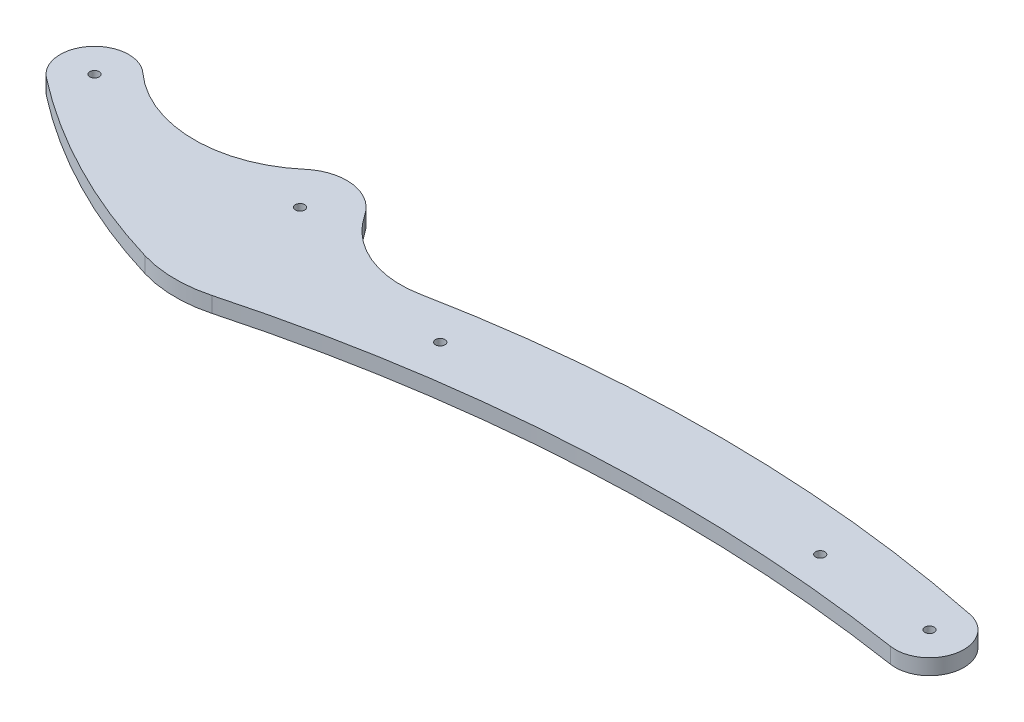
ISO-10303-21;
HEADER;
FILE_DESCRIPTION(('STEP AP214'),'2;1');
FILE_NAME('part.step','',(''),(''),'','','');
FILE_SCHEMA(('AUTOMOTIVE_DESIGN { 1 0 10303 214 1 1 1 1 }'));
ENDSEC;
DATA;
#1=APPLICATION_CONTEXT('core data for automotive mechanical design processes');
#2=APPLICATION_PROTOCOL_DEFINITION('international standard','automotive_design',2000,#1);
#3=PRODUCT_CONTEXT('',#1,'mechanical');
#4=PRODUCT('Part','Part','',(#3));
#5=PRODUCT_RELATED_PRODUCT_CATEGORY('part','',(#4));
#6=PRODUCT_DEFINITION_FORMATION('','',#4);
#7=PRODUCT_DEFINITION_CONTEXT('part definition',#1,'design');
#8=PRODUCT_DEFINITION('design','',#6,#7);
#9=PRODUCT_DEFINITION_SHAPE('','',#8);
#10=(LENGTH_UNIT() NAMED_UNIT(*) SI_UNIT(.MILLI.,.METRE.));
#11=(NAMED_UNIT(*) PLANE_ANGLE_UNIT() SI_UNIT($,.RADIAN.));
#12=(NAMED_UNIT(*) SI_UNIT($,.STERADIAN.) SOLID_ANGLE_UNIT());
#13=UNCERTAINTY_MEASURE_WITH_UNIT(LENGTH_MEASURE(1.E-05),#10,'distance_accuracy_value','');
#14=(GEOMETRIC_REPRESENTATION_CONTEXT(3) GLOBAL_UNCERTAINTY_ASSIGNED_CONTEXT((#13)) GLOBAL_UNIT_ASSIGNED_CONTEXT((#10,
#11,#12)) REPRESENTATION_CONTEXT('',''));
#15=CARTESIAN_POINT('',(0.,0.,0.));
#16=DIRECTION('',(0.,0.,1.));
#17=DIRECTION('',(1.,0.,0.));
#18=AXIS2_PLACEMENT_3D('',#15,#16,#17);
#19=CARTESIAN_POINT('',(288.5,5.,20.4));
#20=DIRECTION('',(0.,-1.,0.));
#21=DIRECTION('',(0.,0.,-1.));
#22=AXIS2_PLACEMENT_3D('',#19,#20,#21);
#23=CYLINDRICAL_SURFACE('',#22,11.);
#24=CARTESIAN_POINT('',(288.5,0.,20.4));
#25=DIRECTION('',(0.,1.,0.));
#26=DIRECTION('',(0.,0.,1.));
#27=AXIS2_PLACEMENT_3D('',#24,#25,#26);
#28=CIRCLE('',#27,11.);
#29=CARTESIAN_POINT('',(286.820423182921,0.,31.2710175105889));
#30=VERTEX_POINT('',#29);
#31=CARTESIAN_POINT('',(290.713941840011,0.,9.62510039355124));
#32=VERTEX_POINT('',#31);
#33=EDGE_CURVE('E175',#30,#32,#28,.T.);
#34=ORIENTED_EDGE('',*,*,#33,.T.);
#35=DIRECTION('',(0.,-1.,0.));
#36=VECTOR('',#35,1.);
#37=CARTESIAN_POINT('',(290.713941840011,5.,9.62510039355124));
#38=LINE('',#37,#36);
#39=CARTESIAN_POINT('',(290.713941840011,5.,9.62510039355124));
#40=VERTEX_POINT('',#39);
#41=EDGE_CURVE('E11',#40,#32,#38,.T.);
#42=ORIENTED_EDGE('',*,*,#41,.F.);
#43=CARTESIAN_POINT('',(288.5,5.,20.4));
#44=DIRECTION('',(0.,1.,0.));
#45=DIRECTION('',(0.,0.,1.));
#46=AXIS2_PLACEMENT_3D('',#43,#44,#45);
#47=CIRCLE('',#46,11.);
#48=CARTESIAN_POINT('',(286.820423182921,5.,31.2710175105889));
#49=VERTEX_POINT('',#48);
#50=EDGE_CURVE('E247',#49,#40,#47,.T.);
#51=ORIENTED_EDGE('',*,*,#50,.F.);
#52=DIRECTION('',(0.,-1.,0.));
#53=VECTOR('',#52,1.);
#54=CARTESIAN_POINT('',(286.820423182921,5.,31.2710175105889));
#55=LINE('',#54,#53);
#56=EDGE_CURVE('E63',#49,#30,#55,.T.);
#57=ORIENTED_EDGE('',*,*,#56,.T.);
#58=EDGE_LOOP('',(#34,#42,#51,#57));
#59=FACE_BOUND('',#58,.T.);
#60=ADVANCED_FACE('F45',(#59),#23,.T.);
#61=CARTESIAN_POINT('',(200.143593839572,5.,450.416447930092));
#62=DIRECTION('',(0.,-1.,0.));
#63=DIRECTION('',(0.,0.,-1.));
#64=AXIS2_PLACEMENT_3D('',#61,#62,#63);
#65=CYLINDRICAL_SURFACE('',#64,450.);
#66=CARTESIAN_POINT('',(200.143593839572,0.,450.416447930092));
#67=DIRECTION('',(0.,1.,0.));
#68=DIRECTION('',(0.,0.,1.));
#69=AXIS2_PLACEMENT_3D('',#66,#67,#68);
#70=CIRCLE('',#69,450.);
#71=CARTESIAN_POINT('',(113.463070734292,0.,8.84370543550006));
#72=VERTEX_POINT('',#71);
#73=EDGE_CURVE('E178',#32,#72,#70,.T.);
#74=ORIENTED_EDGE('',*,*,#73,.T.);
#75=DIRECTION('',(0.,-1.,0.));
#76=VECTOR('',#75,1.);
#77=CARTESIAN_POINT('',(113.463070734292,5.,8.84370543550006));
#78=LINE('',#77,#76);
#79=CARTESIAN_POINT('',(113.463070734292,5.,8.84370543550006));
#80=VERTEX_POINT('',#79);
#81=EDGE_CURVE('E55',#80,#72,#78,.T.);
#82=ORIENTED_EDGE('',*,*,#81,.F.);
#83=CARTESIAN_POINT('',(200.143593839572,5.,450.416447930092));
#84=DIRECTION('',(0.,1.,0.));
#85=DIRECTION('',(0.,0.,1.));
#86=AXIS2_PLACEMENT_3D('',#83,#84,#85);
#87=CIRCLE('',#86,450.);
#88=EDGE_CURVE('E105',#40,#80,#87,.T.);
#89=ORIENTED_EDGE('',*,*,#88,.F.);
#90=ORIENTED_EDGE('',*,*,#41,.T.);
#91=EDGE_LOOP('',(#74,#82,#89,#90));
#92=FACE_BOUND('',#91,.T.);
#93=ADVANCED_FACE('F228',(#92),#65,.T.);
#94=CARTESIAN_POINT('',(107.68436919394,5.,-20.5944773974727));
#95=DIRECTION('',(0.,-1.,0.));
#96=DIRECTION('',(0.,0.,-1.));
#97=AXIS2_PLACEMENT_3D('',#94,#95,#96);
#98=CYLINDRICAL_SURFACE('',#97,30.);
#99=CARTESIAN_POINT('',(107.68436919394,0.,-20.5944773974727));
#100=DIRECTION('',(0.,1.,0.));
#101=DIRECTION('',(0.,0.,1.));
#102=AXIS2_PLACEMENT_3D('',#99,#100,#101);
#103=CIRCLE('',#102,30.);
#104=CARTESIAN_POINT('',(82.5614563979801,0.,-4.19815913249092));
#105=VERTEX_POINT('',#104);
#106=EDGE_CURVE('E182',#105,#72,#103,.T.);
#107=ORIENTED_EDGE('',*,*,#106,.F.);
#108=DIRECTION('',(0.,-1.,0.));
#109=VECTOR('',#108,1.);
#110=CARTESIAN_POINT('',(82.5614563979801,5.,-4.19815913249092));
#111=LINE('',#110,#109);
#112=CARTESIAN_POINT('',(82.5614563979801,5.,-4.19815913249092));
#113=VERTEX_POINT('',#112);
#114=EDGE_CURVE('E219',#113,#105,#111,.T.);
#115=ORIENTED_EDGE('',*,*,#114,.F.);
#116=CARTESIAN_POINT('',(107.68436919394,5.,-20.5944773974727));
#117=DIRECTION('',(0.,1.,0.));
#118=DIRECTION('',(0.,0.,1.));
#119=AXIS2_PLACEMENT_3D('',#116,#117,#118);
#120=CIRCLE('',#119,30.);
#121=EDGE_CURVE('E227',#113,#80,#120,.T.);
#122=ORIENTED_EDGE('',*,*,#121,.T.);
#123=ORIENTED_EDGE('',*,*,#81,.T.);
#124=EDGE_LOOP('',(#107,#115,#122,#123));
#125=FACE_BOUND('',#124,.T.);
#126=ADVANCED_FACE('F225',(#125),#98,.F.);
#127=CARTESIAN_POINT('',(70.,5.,4.));
#128=DIRECTION('',(0.,-1.,0.));
#129=DIRECTION('',(0.,0.,-1.));
#130=AXIS2_PLACEMENT_3D('',#127,#128,#129);
#131=CYLINDRICAL_SURFACE('',#130,15.);
#132=CARTESIAN_POINT('',(70.,0.,4.));
#133=DIRECTION('',(0.,1.,0.));
#134=DIRECTION('',(0.,0.,1.));
#135=AXIS2_PLACEMENT_3D('',#132,#133,#134);
#136=CIRCLE('',#135,15.);
#137=CARTESIAN_POINT('',(60.2487118059048,0.,-7.39791114878956));
#138=VERTEX_POINT('',#137);
#139=EDGE_CURVE('E186',#105,#138,#136,.T.);
#140=ORIENTED_EDGE('',*,*,#139,.T.);
#141=DIRECTION('',(0.,-1.,0.));
#142=VECTOR('',#141,1.);
#143=CARTESIAN_POINT('',(60.2487118059048,5.,-7.39791114878956));
#144=LINE('',#143,#142);
#145=CARTESIAN_POINT('',(60.2487118059048,5.,-7.39791114878956));
#146=VERTEX_POINT('',#145);
#147=EDGE_CURVE('E216',#146,#138,#144,.T.);
#148=ORIENTED_EDGE('',*,*,#147,.F.);
#149=CARTESIAN_POINT('',(70.,5.,4.));
#150=DIRECTION('',(0.,1.,0.));
#151=DIRECTION('',(0.,0.,1.));
#152=AXIS2_PLACEMENT_3D('',#149,#150,#151);
#153=CIRCLE('',#152,15.);
#154=EDGE_CURVE('E240',#113,#146,#153,.T.);
#155=ORIENTED_EDGE('',*,*,#154,.F.);
#156=ORIENTED_EDGE('',*,*,#114,.T.);
#157=EDGE_LOOP('',(#140,#148,#155,#156));
#158=FACE_BOUND('',#157,.T.);
#159=ADVANCED_FACE('F237',(#158),#131,.T.);
#160=CARTESIAN_POINT('',(34.2452766216511,5.,-37.792340878895));
#161=DIRECTION('',(0.,-1.,0.));
#162=DIRECTION('',(0.,0.,-1.));
#163=AXIS2_PLACEMENT_3D('',#160,#161,#162);
#164=CYLINDRICAL_SURFACE('',#163,40.);
#165=CARTESIAN_POINT('',(34.2452766216511,0.,-37.792340878895));
#166=DIRECTION('',(0.,1.,0.));
#167=DIRECTION('',(0.,0.,1.));
#168=AXIS2_PLACEMENT_3D('',#165,#166,#167);
#169=CIRCLE('',#168,40.);
#170=CARTESIAN_POINT('',(7.38623613408162,0.,-8.15128920917342));
#171=VERTEX_POINT('',#170);
#172=EDGE_CURVE('E190',#171,#138,#169,.T.);
#173=ORIENTED_EDGE('',*,*,#172,.F.);
#174=DIRECTION('',(0.,-1.,0.));
#175=VECTOR('',#174,1.);
#176=CARTESIAN_POINT('',(7.38623613408162,5.,-8.15128920917342));
#177=LINE('',#176,#175);
#178=CARTESIAN_POINT('',(7.38623613408162,5.,-8.15128920917342));
#179=VERTEX_POINT('',#178);
#180=EDGE_CURVE('E213',#179,#171,#177,.T.);
#181=ORIENTED_EDGE('',*,*,#180,.F.);
#182=CARTESIAN_POINT('',(34.2452766216511,5.,-37.792340878895));
#183=DIRECTION('',(0.,1.,0.));
#184=DIRECTION('',(0.,0.,1.));
#185=AXIS2_PLACEMENT_3D('',#182,#183,#184);
#186=CIRCLE('',#185,40.);
#187=EDGE_CURVE('E242',#179,#146,#186,.T.);
#188=ORIENTED_EDGE('',*,*,#187,.T.);
#189=ORIENTED_EDGE('',*,*,#147,.T.);
#190=EDGE_LOOP('',(#173,#181,#188,#189));
#191=FACE_BOUND('',#190,.T.);
#192=ADVANCED_FACE('F254',(#191),#164,.F.);
#193=CARTESIAN_POINT('',(0.,5.,0.));
#194=DIRECTION('',(0.,-1.,0.));
#195=DIRECTION('',(0.,0.,-1.));
#196=AXIS2_PLACEMENT_3D('',#193,#194,#195);
#197=CYLINDRICAL_SURFACE('',#196,11.);
#198=CARTESIAN_POINT('',(0.,0.,0.));
#199=DIRECTION('',(0.,1.,0.));
#200=DIRECTION('',(0.,0.,1.));
#201=AXIS2_PLACEMENT_3D('',#198,#199,#200);
#202=CIRCLE('',#201,11.);
#203=CARTESIAN_POINT('',(-6.74762763379508,0.,8.6873195702498));
#204=VERTEX_POINT('',#203);
#205=EDGE_CURVE('E194',#171,#204,#202,.T.);
#206=ORIENTED_EDGE('',*,*,#205,.T.);
#207=DIRECTION('',(0.,-1.,0.));
#208=VECTOR('',#207,1.);
#209=CARTESIAN_POINT('',(-6.74762763379508,5.,8.6873195702498));
#210=LINE('',#209,#208);
#211=CARTESIAN_POINT('',(-6.74762763379508,5.,8.6873195702498));
#212=VERTEX_POINT('',#211);
#213=EDGE_CURVE('E145',#212,#204,#210,.T.);
#214=ORIENTED_EDGE('',*,*,#213,.F.);
#215=CARTESIAN_POINT('',(0.,5.,0.));
#216=DIRECTION('',(0.,1.,0.));
#217=DIRECTION('',(0.,0.,1.));
#218=AXIS2_PLACEMENT_3D('',#215,#216,#217);
#219=CIRCLE('',#218,11.);
#220=EDGE_CURVE('E131',#179,#212,#219,.T.);
#221=ORIENTED_EDGE('',*,*,#220,.F.);
#222=ORIENTED_EDGE('',*,*,#180,.T.);
#223=EDGE_LOOP('',(#206,#214,#221,#222));
#224=FACE_BOUND('',#223,.T.);
#225=ADVANCED_FACE('F256',(#224),#197,.T.);
#226=CARTESIAN_POINT('',(115.936511162479,5.,-149.263945343383));
#227=DIRECTION('',(0.,-1.,0.));
#228=DIRECTION('',(0.,0.,-1.));
#229=AXIS2_PLACEMENT_3D('',#226,#227,#228);
#230=CYLINDRICAL_SURFACE('',#229,200.);
#231=CARTESIAN_POINT('',(115.936511162479,0.,-149.263945343383));
#232=DIRECTION('',(0.,1.,0.));
#233=DIRECTION('',(0.,0.,1.));
#234=AXIS2_PLACEMENT_3D('',#231,#232,#233);
#235=CIRCLE('',#234,200.);
#236=CARTESIAN_POINT('',(58.5158722093802,0.,42.3159863358457));
#237=VERTEX_POINT('',#236);
#238=EDGE_CURVE('E141',#204,#237,#235,.T.);
#239=ORIENTED_EDGE('',*,*,#238,.T.);
#240=DIRECTION('',(0.,-1.,0.));
#241=VECTOR('',#240,1.);
#242=CARTESIAN_POINT('',(58.5158722093802,5.,42.3159863358457));
#243=LINE('',#242,#241);
#244=CARTESIAN_POINT('',(58.5158722093802,5.,42.3159863358457));
#245=VERTEX_POINT('',#244);
#246=EDGE_CURVE('E138',#245,#237,#243,.T.);
#247=ORIENTED_EDGE('',*,*,#246,.F.);
#248=CARTESIAN_POINT('',(115.936511162479,5.,-149.263945343383));
#249=DIRECTION('',(0.,1.,0.));
#250=DIRECTION('',(0.,0.,1.));
#251=AXIS2_PLACEMENT_3D('',#248,#249,#250);
#252=CIRCLE('',#251,200.);
#253=EDGE_CURVE('E123',#212,#245,#252,.T.);
#254=ORIENTED_EDGE('',*,*,#253,.F.);
#255=ORIENTED_EDGE('',*,*,#213,.T.);
#256=EDGE_LOOP('',(#239,#247,#254,#255));
#257=FACE_BOUND('',#256,.T.);
#258=ADVANCED_FACE('F139',(#257),#230,.T.);
#259=CARTESIAN_POINT('',(70.,5.,4.));
#260=DIRECTION('',(0.,-1.,0.));
#261=DIRECTION('',(0.,0.,-1.));
#262=AXIS2_PLACEMENT_3D('',#259,#260,#261);
#263=CYLINDRICAL_SURFACE('',#262,40.);
#264=CARTESIAN_POINT('',(70.,0.,4.));
#265=DIRECTION('',(0.,1.,0.));
#266=DIRECTION('',(0.,0.,1.));
#267=AXIS2_PLACEMENT_3D('',#264,#265,#266);
#268=CIRCLE('',#267,40.);
#269=CARTESIAN_POINT('',(80.4056312893777,0.,42.6228279320601));
#270=VERTEX_POINT('',#269);
#271=EDGE_CURVE('E199',#237,#270,#268,.T.);
#272=ORIENTED_EDGE('',*,*,#271,.T.);
#273=DIRECTION('',(0.,-1.,0.));
#274=VECTOR('',#273,1.);
#275=CARTESIAN_POINT('',(80.4056312893777,5.,42.6228279320601));
#276=LINE('',#275,#274);
#277=CARTESIAN_POINT('',(80.4056312893777,5.,42.6228279320601));
#278=VERTEX_POINT('',#277);
#279=EDGE_CURVE('E93',#278,#270,#276,.T.);
#280=ORIENTED_EDGE('',*,*,#279,.F.);
#281=CARTESIAN_POINT('',(70.,5.,4.));
#282=DIRECTION('',(0.,1.,0.));
#283=DIRECTION('',(0.,0.,1.));
#284=AXIS2_PLACEMENT_3D('',#281,#282,#283);
#285=CIRCLE('',#284,40.);
#286=EDGE_CURVE('E128',#245,#278,#285,.T.);
#287=ORIENTED_EDGE('',*,*,#286,.F.);
#288=ORIENTED_EDGE('',*,*,#246,.T.);
#289=EDGE_LOOP('',(#272,#280,#287,#288));
#290=FACE_BOUND('',#289,.T.);
#291=ADVANCED_FACE('F147',(#290),#263,.T.);
#292=CARTESIAN_POINT('',(288.5,5.,20.4));
#293=DIRECTION('',(0.,-1.,0.));
#294=DIRECTION('',(0.,0.,-1.));
#295=AXIS2_PLACEMENT_3D('',#292,#293,#294);
#296=CYLINDRICAL_SURFACE('',#295,1.49999999999997);
#297=CARTESIAN_POINT('',(288.5,5.,20.4));
#298=DIRECTION('',(0.,1.,0.));
#299=DIRECTION('',(0.,0.,1.));
#300=AXIS2_PLACEMENT_3D('',#297,#298,#299);
#301=CIRCLE('',#300,1.49999999999997);
#302=CARTESIAN_POINT('',(288.5,5.,21.9));
#303=VERTEX_POINT('',#302);
#304=EDGE_CURVE('E459',#303,#303,#301,.T.);
#305=ORIENTED_EDGE('',*,*,#304,.T.);
#306=EDGE_LOOP('',(#305));
#307=FACE_BOUND('',#306,.T.);
#308=CARTESIAN_POINT('',(288.5,0.,20.4));
#309=DIRECTION('',(0.,1.,0.));
#310=DIRECTION('',(0.,0.,1.));
#311=AXIS2_PLACEMENT_3D('',#308,#309,#310);
#312=CIRCLE('',#311,1.49999999999997);
#313=CARTESIAN_POINT('',(288.5,0.,21.9));
#314=VERTEX_POINT('',#313);
#315=EDGE_CURVE('E171',#314,#314,#312,.T.);
#316=ORIENTED_EDGE('',*,*,#315,.F.);
#317=EDGE_LOOP('',(#316));
#318=FACE_BOUND('',#317,.T.);
#319=ADVANCED_FACE('F278',(#307,#318),#296,.F.);
#320=CARTESIAN_POINT('',(70.,5.,4.));
#321=DIRECTION('',(0.,-1.,0.));
#322=DIRECTION('',(0.,0.,-1.));
#323=AXIS2_PLACEMENT_3D('',#320,#321,#322);
#324=CYLINDRICAL_SURFACE('',#323,1.50000000000001);
#325=CARTESIAN_POINT('',(70.,5.,4.));
#326=DIRECTION('',(0.,1.,0.));
#327=DIRECTION('',(0.,0.,1.));
#328=AXIS2_PLACEMENT_3D('',#325,#326,#327);
#329=CIRCLE('',#328,1.50000000000001);
#330=CARTESIAN_POINT('',(70.,5.,5.50000000000001));
#331=VERTEX_POINT('',#330);
#332=EDGE_CURVE('E451',#331,#331,#329,.T.);
#333=ORIENTED_EDGE('',*,*,#332,.T.);
#334=EDGE_LOOP('',(#333));
#335=FACE_BOUND('',#334,.T.);
#336=CARTESIAN_POINT('',(70.,0.,4.));
#337=DIRECTION('',(0.,1.,0.));
#338=DIRECTION('',(0.,0.,1.));
#339=AXIS2_PLACEMENT_3D('',#336,#337,#338);
#340=CIRCLE('',#339,1.50000000000001);
#341=CARTESIAN_POINT('',(70.,0.,5.50000000000001));
#342=VERTEX_POINT('',#341);
#343=EDGE_CURVE('E167',#342,#342,#340,.T.);
#344=ORIENTED_EDGE('',*,*,#343,.F.);
#345=EDGE_LOOP('',(#344));
#346=FACE_BOUND('',#345,.T.);
#347=ADVANCED_FACE('F281',(#335,#346),#324,.F.);
#348=CARTESIAN_POINT('',(0.,5.,0.));
#349=DIRECTION('',(0.,-1.,0.));
#350=DIRECTION('',(0.,0.,-1.));
#351=AXIS2_PLACEMENT_3D('',#348,#349,#350);
#352=CYLINDRICAL_SURFACE('',#351,1.5);
#353=CARTESIAN_POINT('',(0.,5.,0.));
#354=DIRECTION('',(0.,1.,0.));
#355=DIRECTION('',(0.,0.,1.));
#356=AXIS2_PLACEMENT_3D('',#353,#354,#355);
#357=CIRCLE('',#356,1.5);
#358=CARTESIAN_POINT('',(0.,5.,1.5));
#359=VERTEX_POINT('',#358);
#360=EDGE_CURVE('E446',#359,#359,#357,.T.);
#361=ORIENTED_EDGE('',*,*,#360,.T.);
#362=EDGE_LOOP('',(#361));
#363=FACE_BOUND('',#362,.T.);
#364=CARTESIAN_POINT('',(0.,0.,0.));
#365=DIRECTION('',(0.,1.,0.));
#366=DIRECTION('',(0.,0.,1.));
#367=AXIS2_PLACEMENT_3D('',#364,#365,#366);
#368=CIRCLE('',#367,1.5);
#369=CARTESIAN_POINT('',(0.,0.,1.5));
#370=VERTEX_POINT('',#369);
#371=EDGE_CURVE('E163',#370,#370,#368,.T.);
#372=ORIENTED_EDGE('',*,*,#371,.F.);
#373=EDGE_LOOP('',(#372));
#374=FACE_BOUND('',#373,.T.);
#375=ADVANCED_FACE('F285',(#363,#374),#352,.F.);
#376=CARTESIAN_POINT('',(130.,5.,19.));
#377=DIRECTION('',(0.,-1.,0.));
#378=DIRECTION('',(0.,0.,-1.));
#379=AXIS2_PLACEMENT_3D('',#376,#377,#378);
#380=CYLINDRICAL_SURFACE('',#379,1.5);
#381=CARTESIAN_POINT('',(130.,5.,19.));
#382=DIRECTION('',(0.,1.,0.));
#383=DIRECTION('',(0.,0.,1.));
#384=AXIS2_PLACEMENT_3D('',#381,#382,#383);
#385=CIRCLE('',#384,1.5);
#386=CARTESIAN_POINT('',(130.,5.,20.5));
#387=VERTEX_POINT('',#386);
#388=EDGE_CURVE('E296',#387,#387,#385,.T.);
#389=ORIENTED_EDGE('',*,*,#388,.T.);
#390=EDGE_LOOP('',(#389));
#391=FACE_BOUND('',#390,.T.);
#392=CARTESIAN_POINT('',(130.,0.,19.));
#393=DIRECTION('',(0.,1.,0.));
#394=DIRECTION('',(0.,0.,1.));
#395=AXIS2_PLACEMENT_3D('',#392,#393,#394);
#396=CIRCLE('',#395,1.5);
#397=CARTESIAN_POINT('',(130.,0.,20.5));
#398=VERTEX_POINT('',#397);
#399=EDGE_CURVE('E159',#398,#398,#396,.T.);
#400=ORIENTED_EDGE('',*,*,#399,.F.);
#401=EDGE_LOOP('',(#400));
#402=FACE_BOUND('',#401,.T.);
#403=ADVANCED_FACE('F266',(#391,#402),#380,.F.);
#404=CARTESIAN_POINT('',(250.,5.,17.));
#405=DIRECTION('',(0.,-1.,0.));
#406=DIRECTION('',(0.,0.,-1.));
#407=AXIS2_PLACEMENT_3D('',#404,#405,#406);
#408=CYLINDRICAL_SURFACE('',#407,1.50000000000002);
#409=CARTESIAN_POINT('',(250.,5.,17.));
#410=DIRECTION('',(0.,1.,0.));
#411=DIRECTION('',(0.,0.,1.));
#412=AXIS2_PLACEMENT_3D('',#409,#410,#411);
#413=CIRCLE('',#412,1.50000000000002);
#414=CARTESIAN_POINT('',(250.,5.,18.5));
#415=VERTEX_POINT('',#414);
#416=EDGE_CURVE('E206',#415,#415,#413,.T.);
#417=ORIENTED_EDGE('',*,*,#416,.T.);
#418=EDGE_LOOP('',(#417));
#419=FACE_BOUND('',#418,.T.);
#420=CARTESIAN_POINT('',(250.,0.,17.));
#421=DIRECTION('',(0.,1.,0.));
#422=DIRECTION('',(0.,0.,1.));
#423=AXIS2_PLACEMENT_3D('',#420,#421,#422);
#424=CIRCLE('',#423,1.50000000000002);
#425=CARTESIAN_POINT('',(250.,0.,18.5));
#426=VERTEX_POINT('',#425);
#427=EDGE_CURVE('E155',#426,#426,#424,.T.);
#428=ORIENTED_EDGE('',*,*,#427,.F.);
#429=EDGE_LOOP('',(#428));
#430=FACE_BOUND('',#429,.T.);
#431=ADVANCED_FACE('F47',(#419,#430),#408,.F.);
#432=CARTESIAN_POINT('',(210.476022406599,5.,525.408177082812));
#433=DIRECTION('',(0.,-1.,0.));
#434=DIRECTION('',(0.,0.,-1.));
#435=AXIS2_PLACEMENT_3D('',#432,#433,#434);
#436=CYLINDRICAL_SURFACE('',#435,500.);
#437=CARTESIAN_POINT('',(210.476022406599,0.,525.408177082812));
#438=DIRECTION('',(0.,1.,0.));
#439=DIRECTION('',(0.,0.,1.));
#440=AXIS2_PLACEMENT_3D('',#437,#438,#439);
#441=CIRCLE('',#440,500.);
#442=EDGE_CURVE('E202',#30,#270,#441,.T.);
#443=ORIENTED_EDGE('',*,*,#442,.F.);
#444=ORIENTED_EDGE('',*,*,#56,.F.);
#445=CARTESIAN_POINT('',(210.476022406599,5.,525.408177082812));
#446=DIRECTION('',(0.,1.,0.));
#447=DIRECTION('',(0.,0.,1.));
#448=AXIS2_PLACEMENT_3D('',#445,#446,#447);
#449=CIRCLE('',#448,500.);
#450=EDGE_CURVE('E149',#49,#278,#449,.T.);
#451=ORIENTED_EDGE('',*,*,#450,.T.);
#452=ORIENTED_EDGE('',*,*,#279,.T.);
#453=EDGE_LOOP('',(#443,#444,#451,#452));
#454=FACE_BOUND('',#453,.T.);
#455=ADVANCED_FACE('F257',(#454),#436,.F.);
#456=CARTESIAN_POINT('',(0.,5.,0.));
#457=DIRECTION('',(0.,1.,0.));
#458=DIRECTION('',(0.,0.,1.));
#459=AXIS2_PLACEMENT_3D('',#456,#457,#458);
#460=PLANE('',#459);
#461=ORIENTED_EDGE('',*,*,#416,.F.);
#462=EDGE_LOOP('',(#461));
#463=FACE_BOUND('',#462,.T.);
#464=ORIENTED_EDGE('',*,*,#388,.F.);
#465=EDGE_LOOP('',(#464));
#466=FACE_BOUND('',#465,.T.);
#467=ORIENTED_EDGE('',*,*,#360,.F.);
#468=EDGE_LOOP('',(#467));
#469=FACE_BOUND('',#468,.T.);
#470=ORIENTED_EDGE('',*,*,#332,.F.);
#471=EDGE_LOOP('',(#470));
#472=FACE_BOUND('',#471,.T.);
#473=ORIENTED_EDGE('',*,*,#304,.F.);
#474=EDGE_LOOP('',(#473));
#475=FACE_BOUND('',#474,.T.);
#476=ORIENTED_EDGE('',*,*,#50,.T.);
#477=ORIENTED_EDGE('',*,*,#88,.T.);
#478=ORIENTED_EDGE('',*,*,#121,.F.);
#479=ORIENTED_EDGE('',*,*,#154,.T.);
#480=ORIENTED_EDGE('',*,*,#187,.F.);
#481=ORIENTED_EDGE('',*,*,#220,.T.);
#482=ORIENTED_EDGE('',*,*,#253,.T.);
#483=ORIENTED_EDGE('',*,*,#286,.T.);
#484=ORIENTED_EDGE('',*,*,#450,.F.);
#485=EDGE_LOOP('',(#476,#477,#478,#479,#480,#481,#482,#483,#484));
#486=FACE_BOUND('',#485,.T.);
#487=ADVANCED_FACE('F125',(#463,#466,#469,#472,#475,#486),#460,.T.);
#488=CARTESIAN_POINT('',(0.,0.,0.));
#489=DIRECTION('',(0.,1.,0.));
#490=DIRECTION('',(0.,0.,1.));
#491=AXIS2_PLACEMENT_3D('',#488,#489,#490);
#492=PLANE('',#491);
#493=ORIENTED_EDGE('',*,*,#427,.T.);
#494=EDGE_LOOP('',(#493));
#495=FACE_BOUND('',#494,.T.);
#496=ORIENTED_EDGE('',*,*,#399,.T.);
#497=EDGE_LOOP('',(#496));
#498=FACE_BOUND('',#497,.T.);
#499=ORIENTED_EDGE('',*,*,#371,.T.);
#500=EDGE_LOOP('',(#499));
#501=FACE_BOUND('',#500,.T.);
#502=ORIENTED_EDGE('',*,*,#343,.T.);
#503=EDGE_LOOP('',(#502));
#504=FACE_BOUND('',#503,.T.);
#505=ORIENTED_EDGE('',*,*,#315,.T.);
#506=EDGE_LOOP('',(#505));
#507=FACE_BOUND('',#506,.T.);
#508=ORIENTED_EDGE('',*,*,#33,.F.);
#509=ORIENTED_EDGE('',*,*,#442,.T.);
#510=ORIENTED_EDGE('',*,*,#271,.F.);
#511=ORIENTED_EDGE('',*,*,#238,.F.);
#512=ORIENTED_EDGE('',*,*,#205,.F.);
#513=ORIENTED_EDGE('',*,*,#172,.T.);
#514=ORIENTED_EDGE('',*,*,#139,.F.);
#515=ORIENTED_EDGE('',*,*,#106,.T.);
#516=ORIENTED_EDGE('',*,*,#73,.F.);
#517=EDGE_LOOP('',(#508,#509,#510,#511,#512,#513,#514,#515,#516));
#518=FACE_BOUND('',#517,.T.);
#519=ADVANCED_FACE('F232',(#495,#498,#501,#504,#507,#518),#492,.F.);
#520=CLOSED_SHELL('',(#60,#93,#126,#159,#192,#225,#258,#291,#319,#347,#375,#403,#431,#455,#487,#519));
#521=MANIFOLD_SOLID_BREP('B2',#520);
#522=ADVANCED_BREP_SHAPE_REPRESENTATION('',(#18,#521),#14);
#523=SHAPE_DEFINITION_REPRESENTATION(#9,#522);
ENDSEC;
END-ISO-10303-21;
